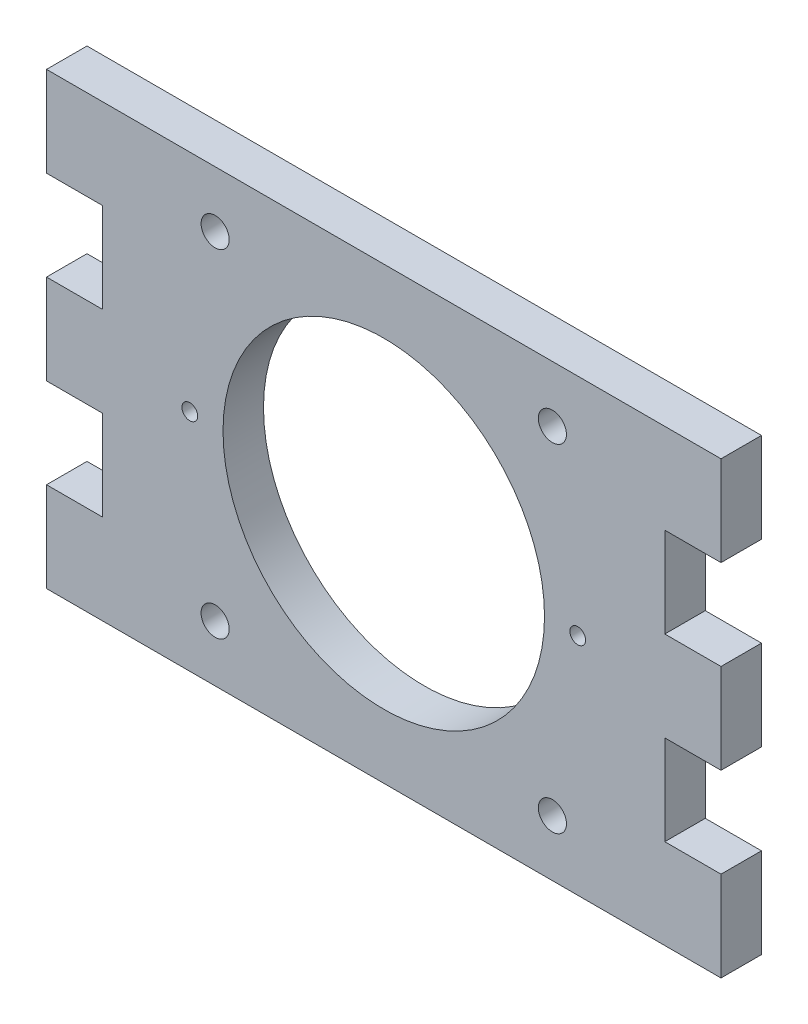
ISO-10303-21;
HEADER;
FILE_DESCRIPTION(('STEP AP214'),'2;1');
FILE_NAME('part.step','',(''),(''),'','','');
FILE_SCHEMA(('AUTOMOTIVE_DESIGN { 1 0 10303 214 1 1 1 1 }'));
ENDSEC;
DATA;
#1=APPLICATION_CONTEXT('core data for automotive mechanical design processes');
#2=APPLICATION_PROTOCOL_DEFINITION('international standard','automotive_design',2000,#1);
#3=PRODUCT_CONTEXT('',#1,'mechanical');
#4=PRODUCT('Part','Part','',(#3));
#5=PRODUCT_RELATED_PRODUCT_CATEGORY('part','',(#4));
#6=PRODUCT_DEFINITION_FORMATION('','',#4);
#7=PRODUCT_DEFINITION_CONTEXT('part definition',#1,'design');
#8=PRODUCT_DEFINITION('design','',#6,#7);
#9=PRODUCT_DEFINITION_SHAPE('','',#8);
#10=(LENGTH_UNIT() NAMED_UNIT(*) SI_UNIT(.MILLI.,.METRE.));
#11=(NAMED_UNIT(*) PLANE_ANGLE_UNIT() SI_UNIT($,.RADIAN.));
#12=(NAMED_UNIT(*) SI_UNIT($,.STERADIAN.) SOLID_ANGLE_UNIT());
#13=UNCERTAINTY_MEASURE_WITH_UNIT(LENGTH_MEASURE(1.E-05),#10,'distance_accuracy_value','');
#14=(GEOMETRIC_REPRESENTATION_CONTEXT(3) GLOBAL_UNCERTAINTY_ASSIGNED_CONTEXT((#13)) GLOBAL_UNIT_ASSIGNED_CONTEXT((#10,
#11,#12)) REPRESENTATION_CONTEXT('',''));
#15=CARTESIAN_POINT('',(0.,0.,0.));
#16=DIRECTION('',(0.,0.,1.));
#17=DIRECTION('',(1.,0.,0.));
#18=AXIS2_PLACEMENT_3D('',#15,#16,#17);
#19=CARTESIAN_POINT('',(0.,50.8,4.572));
#20=DIRECTION('',(0.,0.,-1.));
#21=DIRECTION('',(-1.,0.,0.));
#22=AXIS2_PLACEMENT_3D('',#19,#20,#21);
#23=PLANE('',#22);
#24=CARTESIAN_POINT('',(57.1500000000031,44.4500000000028,4.572));
#25=DIRECTION('',(0.,0.,-1.));
#26=DIRECTION('',(-1.,0.,0.));
#27=AXIS2_PLACEMENT_3D('',#24,#25,#26);
#28=CIRCLE('',#27,1.58750000000206);
#29=CARTESIAN_POINT('',(55.562500000001,44.4500000000028,4.572));
#30=VERTEX_POINT('',#29);
#31=EDGE_CURVE('E275',#30,#30,#28,.T.);
#32=ORIENTED_EDGE('',*,*,#31,.T.);
#33=EDGE_LOOP('',(#32));
#34=FACE_BOUND('',#33,.T.);
#35=CARTESIAN_POINT('',(19.0499999999992,44.4500000000001,4.572));
#36=DIRECTION('',(0.,0.,-1.));
#37=DIRECTION('',(-1.,0.,0.));
#38=AXIS2_PLACEMENT_3D('',#35,#36,#37);
#39=CIRCLE('',#38,1.58749999999917);
#40=CARTESIAN_POINT('',(17.4625,44.4500000000001,4.572));
#41=VERTEX_POINT('',#40);
#42=EDGE_CURVE('E282',#41,#41,#39,.T.);
#43=ORIENTED_EDGE('',*,*,#42,.T.);
#44=EDGE_LOOP('',(#43));
#45=FACE_BOUND('',#44,.T.);
#46=CARTESIAN_POINT('',(57.15,6.34999999999998,4.572));
#47=DIRECTION('',(0.,0.,-1.));
#48=DIRECTION('',(-1.,0.,0.));
#49=AXIS2_PLACEMENT_3D('',#46,#47,#48);
#50=CIRCLE('',#49,1.5875);
#51=CARTESIAN_POINT('',(55.5625,6.34999999999998,4.572));
#52=VERTEX_POINT('',#51);
#53=EDGE_CURVE('E288',#52,#52,#50,.T.);
#54=ORIENTED_EDGE('',*,*,#53,.T.);
#55=EDGE_LOOP('',(#54));
#56=FACE_BOUND('',#55,.T.);
#57=CARTESIAN_POINT('',(19.05,6.34999999999997,4.572));
#58=DIRECTION('',(0.,0.,-1.));
#59=DIRECTION('',(-1.,0.,0.));
#60=AXIS2_PLACEMENT_3D('',#57,#58,#59);
#61=CIRCLE('',#60,1.5875);
#62=CARTESIAN_POINT('',(17.4625,6.34999999999997,4.572));
#63=VERTEX_POINT('',#62);
#64=EDGE_CURVE('E294',#63,#63,#61,.T.);
#65=ORIENTED_EDGE('',*,*,#64,.T.);
#66=EDGE_LOOP('',(#65));
#67=FACE_BOUND('',#66,.T.);
#68=CARTESIAN_POINT('',(16.1881750645913,25.4,4.572));
#69=DIRECTION('',(0.,0.,-1.));
#70=DIRECTION('',(-1.,0.,0.));
#71=AXIS2_PLACEMENT_3D('',#68,#69,#70);
#72=CIRCLE('',#71,0.888999999999999);
#73=CARTESIAN_POINT('',(15.2991750645913,25.4,4.572));
#74=VERTEX_POINT('',#73);
#75=EDGE_CURVE('E308',#74,#74,#72,.F.);
#76=ORIENTED_EDGE('',*,*,#75,.F.);
#77=EDGE_LOOP('',(#76));
#78=FACE_BOUND('',#77,.T.);
#79=CARTESIAN_POINT('',(38.1,25.4,4.572));
#80=DIRECTION('',(0.,0.,-1.));
#81=DIRECTION('',(-1.,0.,0.));
#82=AXIS2_PLACEMENT_3D('',#79,#80,#81);
#83=CIRCLE('',#82,18.161);
#84=CARTESIAN_POINT('',(19.939,25.4,4.572));
#85=VERTEX_POINT('',#84);
#86=EDGE_CURVE('E305',#85,#85,#83,.F.);
#87=ORIENTED_EDGE('',*,*,#86,.F.);
#88=EDGE_LOOP('',(#87));
#89=FACE_BOUND('',#88,.T.);
#90=CARTESIAN_POINT('',(60.0118249354087,25.4,4.572));
#91=DIRECTION('',(0.,0.,-1.));
#92=DIRECTION('',(-1.,0.,0.));
#93=AXIS2_PLACEMENT_3D('',#90,#91,#92);
#94=CIRCLE('',#93,0.889000000000003);
#95=CARTESIAN_POINT('',(59.1228249354087,25.4,4.572));
#96=VERTEX_POINT('',#95);
#97=EDGE_CURVE('E311',#96,#96,#94,.F.);
#98=ORIENTED_EDGE('',*,*,#97,.F.);
#99=EDGE_LOOP('',(#98));
#100=FACE_BOUND('',#99,.T.);
#101=DIRECTION('',(-1.,0.,0.));
#102=VECTOR('',#101,1.);
#103=CARTESIAN_POINT('',(76.2,40.64,4.572));
#104=LINE('',#103,#102);
#105=CARTESIAN_POINT('',(76.2,40.64,4.572));
#106=VERTEX_POINT('',#105);
#107=CARTESIAN_POINT('',(69.85,40.64,4.572));
#108=VERTEX_POINT('',#107);
#109=EDGE_CURVE('E218',#106,#108,#104,.T.);
#110=ORIENTED_EDGE('',*,*,#109,.F.);
#111=DIRECTION('',(0.,1.,0.));
#112=VECTOR('',#111,1.);
#113=CARTESIAN_POINT('',(76.2,0.,4.572));
#114=LINE('',#113,#112);
#115=CARTESIAN_POINT('',(76.2,50.8,4.572));
#116=VERTEX_POINT('',#115);
#117=EDGE_CURVE('E322',#106,#116,#114,.T.);
#118=ORIENTED_EDGE('',*,*,#117,.T.);
#119=DIRECTION('',(-1.,0.,0.));
#120=VECTOR('',#119,1.);
#121=CARTESIAN_POINT('',(0.,50.8,4.572));
#122=LINE('',#121,#120);
#123=CARTESIAN_POINT('',(0.,50.8,4.572));
#124=VERTEX_POINT('',#123);
#125=EDGE_CURVE('E324',#116,#124,#122,.T.);
#126=ORIENTED_EDGE('',*,*,#125,.T.);
#127=DIRECTION('',(0.,-1.,0.));
#128=VECTOR('',#127,1.);
#129=CARTESIAN_POINT('',(0.,0.,4.572));
#130=LINE('',#129,#128);
#131=CARTESIAN_POINT('',(0.,40.64,4.572));
#132=VERTEX_POINT('',#131);
#133=EDGE_CURVE('E315',#124,#132,#130,.T.);
#134=ORIENTED_EDGE('',*,*,#133,.T.);
#135=DIRECTION('',(-1.,0.,0.));
#136=VECTOR('',#135,1.);
#137=CARTESIAN_POINT('',(6.34999999999997,40.64,4.572));
#138=LINE('',#137,#136);
#139=CARTESIAN_POINT('',(6.34999999999997,40.64,4.572));
#140=VERTEX_POINT('',#139);
#141=EDGE_CURVE('E265',#140,#132,#138,.T.);
#142=ORIENTED_EDGE('',*,*,#141,.F.);
#143=DIRECTION('',(0.,1.,0.));
#144=VECTOR('',#143,1.);
#145=CARTESIAN_POINT('',(6.34999999999997,0.,4.572));
#146=LINE('',#145,#144);
#147=CARTESIAN_POINT('',(6.34999999999997,30.48,4.572));
#148=VERTEX_POINT('',#147);
#149=EDGE_CURVE('E267',#148,#140,#146,.T.);
#150=ORIENTED_EDGE('',*,*,#149,.F.);
#151=DIRECTION('',(-1.,0.,0.));
#152=VECTOR('',#151,1.);
#153=CARTESIAN_POINT('',(6.34999999999997,30.48,4.572));
#154=LINE('',#153,#152);
#155=CARTESIAN_POINT('',(0.,30.48,4.572));
#156=VERTEX_POINT('',#155);
#157=EDGE_CURVE('E244',#148,#156,#154,.T.);
#158=ORIENTED_EDGE('',*,*,#157,.T.);
#159=CARTESIAN_POINT('',(0.,20.32,4.572));
#160=VERTEX_POINT('',#159);
#161=EDGE_CURVE('E319',#156,#160,#130,.T.);
#162=ORIENTED_EDGE('',*,*,#161,.T.);
#163=DIRECTION('',(-1.,0.,0.));
#164=VECTOR('',#163,1.);
#165=CARTESIAN_POINT('',(6.34999999999997,20.32,4.572));
#166=LINE('',#165,#164);
#167=CARTESIAN_POINT('',(6.34999999999997,20.32,4.572));
#168=VERTEX_POINT('',#167);
#169=EDGE_CURVE('E249',#168,#160,#166,.T.);
#170=ORIENTED_EDGE('',*,*,#169,.F.);
#171=CARTESIAN_POINT('',(6.34999999999997,10.16,4.572));
#172=VERTEX_POINT('',#171);
#173=EDGE_CURVE('E270',#172,#168,#146,.T.);
#174=ORIENTED_EDGE('',*,*,#173,.F.);
#175=DIRECTION('',(-1.,0.,0.));
#176=VECTOR('',#175,1.);
#177=CARTESIAN_POINT('',(6.34999999999997,10.16,4.572));
#178=LINE('',#177,#176);
#179=CARTESIAN_POINT('',(0.,10.16,4.572));
#180=VERTEX_POINT('',#179);
#181=EDGE_CURVE('E228',#172,#180,#178,.T.);
#182=ORIENTED_EDGE('',*,*,#181,.T.);
#183=CARTESIAN_POINT('',(0.,0.,4.572));
#184=VERTEX_POINT('',#183);
#185=EDGE_CURVE('E320',#180,#184,#130,.T.);
#186=ORIENTED_EDGE('',*,*,#185,.T.);
#187=DIRECTION('',(1.,0.,0.));
#188=VECTOR('',#187,1.);
#189=CARTESIAN_POINT('',(0.,0.,4.572));
#190=LINE('',#189,#188);
#191=CARTESIAN_POINT('',(76.2,0.,4.572));
#192=VERTEX_POINT('',#191);
#193=EDGE_CURVE('E318',#184,#192,#190,.T.);
#194=ORIENTED_EDGE('',*,*,#193,.T.);
#195=CARTESIAN_POINT('',(76.2,10.16,4.572));
#196=VERTEX_POINT('',#195);
#197=EDGE_CURVE('E192',#192,#196,#114,.T.);
#198=ORIENTED_EDGE('',*,*,#197,.T.);
#199=DIRECTION('',(-1.,0.,0.));
#200=VECTOR('',#199,1.);
#201=CARTESIAN_POINT('',(76.2,10.16,4.572));
#202=LINE('',#201,#200);
#203=CARTESIAN_POINT('',(69.85,10.16,4.572));
#204=VERTEX_POINT('',#203);
#205=EDGE_CURVE('E57',#196,#204,#202,.T.);
#206=ORIENTED_EDGE('',*,*,#205,.T.);
#207=DIRECTION('',(0.,1.,0.));
#208=VECTOR('',#207,1.);
#209=CARTESIAN_POINT('',(69.85,0.,4.572));
#210=LINE('',#209,#208);
#211=CARTESIAN_POINT('',(69.85,20.32,4.572));
#212=VERTEX_POINT('',#211);
#213=EDGE_CURVE('E179',#204,#212,#210,.T.);
#214=ORIENTED_EDGE('',*,*,#213,.T.);
#215=DIRECTION('',(-1.,0.,0.));
#216=VECTOR('',#215,1.);
#217=CARTESIAN_POINT('',(76.2,20.32,4.572));
#218=LINE('',#217,#216);
#219=CARTESIAN_POINT('',(76.2,20.32,4.572));
#220=VERTEX_POINT('',#219);
#221=EDGE_CURVE('E205',#220,#212,#218,.T.);
#222=ORIENTED_EDGE('',*,*,#221,.F.);
#223=CARTESIAN_POINT('',(76.2,30.48,4.572));
#224=VERTEX_POINT('',#223);
#225=EDGE_CURVE('E325',#220,#224,#114,.T.);
#226=ORIENTED_EDGE('',*,*,#225,.T.);
#227=DIRECTION('',(-1.,0.,0.));
#228=VECTOR('',#227,1.);
#229=CARTESIAN_POINT('',(76.2,30.48,4.572));
#230=LINE('',#229,#228);
#231=CARTESIAN_POINT('',(69.85,30.48,4.572));
#232=VERTEX_POINT('',#231);
#233=EDGE_CURVE('E49',#224,#232,#230,.T.);
#234=ORIENTED_EDGE('',*,*,#233,.T.);
#235=EDGE_CURVE('E187',#232,#108,#210,.T.);
#236=ORIENTED_EDGE('',*,*,#235,.T.);
#237=EDGE_LOOP('',(#110,#118,#126,#134,#142,#150,#158,#162,#170,#174,#182,#186,#194,#198,#206,
#214,#222,#226,#234,#236));
#238=FACE_BOUND('',#237,.T.);
#239=ADVANCED_FACE('F34',(#34,#45,#56,#67,#78,#89,#100,#238),#23,.F.);
#240=CARTESIAN_POINT('',(76.2,0.,4.572));
#241=DIRECTION('',(-1.,0.,0.));
#242=DIRECTION('',(0.,-1.,0.));
#243=AXIS2_PLACEMENT_3D('',#240,#241,#242);
#244=PLANE('',#243);
#245=DIRECTION('',(0.,0.,1.));
#246=VECTOR('',#245,1.);
#247=CARTESIAN_POINT('',(76.2,40.64,4.572));
#248=LINE('',#247,#246);
#249=CARTESIAN_POINT('',(76.2,40.64,0.));
#250=VERTEX_POINT('',#249);
#251=EDGE_CURVE('E214',#250,#106,#248,.T.);
#252=ORIENTED_EDGE('',*,*,#251,.F.);
#253=DIRECTION('',(0.,1.,0.));
#254=VECTOR('',#253,1.);
#255=CARTESIAN_POINT('',(76.2,0.,0.));
#256=LINE('',#255,#254);
#257=CARTESIAN_POINT('',(76.2,50.8,0.));
#258=VERTEX_POINT('',#257);
#259=EDGE_CURVE('E334',#250,#258,#256,.T.);
#260=ORIENTED_EDGE('',*,*,#259,.T.);
#261=DIRECTION('',(0.,0.,-1.));
#262=VECTOR('',#261,1.);
#263=CARTESIAN_POINT('',(76.2,50.8,4.572));
#264=LINE('',#263,#262);
#265=EDGE_CURVE('E343',#116,#258,#264,.T.);
#266=ORIENTED_EDGE('',*,*,#265,.F.);
#267=ORIENTED_EDGE('',*,*,#117,.F.);
#268=EDGE_LOOP('',(#252,#260,#266,#267));
#269=FACE_BOUND('',#268,.T.);
#270=ADVANCED_FACE('F369',(#269),#244,.F.);
#271=DIRECTION('',(0.,0.,1.));
#272=VECTOR('',#271,1.);
#273=CARTESIAN_POINT('',(76.2,20.32,4.572));
#274=LINE('',#273,#272);
#275=CARTESIAN_POINT('',(76.2,20.32,0.));
#276=VERTEX_POINT('',#275);
#277=EDGE_CURVE('E200',#276,#220,#274,.T.);
#278=ORIENTED_EDGE('',*,*,#277,.F.);
#279=CARTESIAN_POINT('',(76.2,30.48,0.));
#280=VERTEX_POINT('',#279);
#281=EDGE_CURVE('E339',#276,#280,#256,.T.);
#282=ORIENTED_EDGE('',*,*,#281,.T.);
#283=DIRECTION('',(0.,0.,-1.));
#284=VECTOR('',#283,1.);
#285=CARTESIAN_POINT('',(76.2,30.48,4.572));
#286=LINE('',#285,#284);
#287=EDGE_CURVE('E198',#224,#280,#286,.T.);
#288=ORIENTED_EDGE('',*,*,#287,.F.);
#289=ORIENTED_EDGE('',*,*,#225,.F.);
#290=EDGE_LOOP('',(#278,#282,#288,#289));
#291=FACE_BOUND('',#290,.T.);
#292=ADVANCED_FACE('F367',(#291),#244,.F.);
#293=DIRECTION('',(0.,0.,-1.));
#294=VECTOR('',#293,1.);
#295=CARTESIAN_POINT('',(76.2,10.16,4.572));
#296=LINE('',#295,#294);
#297=CARTESIAN_POINT('',(76.2,10.16,0.));
#298=VERTEX_POINT('',#297);
#299=EDGE_CURVE('E176',#196,#298,#296,.T.);
#300=ORIENTED_EDGE('',*,*,#299,.F.);
#301=ORIENTED_EDGE('',*,*,#197,.F.);
#302=DIRECTION('',(0.,0.,-1.));
#303=VECTOR('',#302,1.);
#304=CARTESIAN_POINT('',(76.2,0.,4.572));
#305=LINE('',#304,#303);
#306=CARTESIAN_POINT('',(76.2,0.,0.));
#307=VERTEX_POINT('',#306);
#308=EDGE_CURVE('E346',#192,#307,#305,.T.);
#309=ORIENTED_EDGE('',*,*,#308,.T.);
#310=EDGE_CURVE('E335',#307,#298,#256,.T.);
#311=ORIENTED_EDGE('',*,*,#310,.T.);
#312=EDGE_LOOP('',(#300,#301,#309,#311));
#313=FACE_BOUND('',#312,.T.);
#314=ADVANCED_FACE('F365',(#313),#244,.F.);
#315=CARTESIAN_POINT('',(0.,0.,4.572));
#316=DIRECTION('',(1.,0.,0.));
#317=DIRECTION('',(0.,1.,0.));
#318=AXIS2_PLACEMENT_3D('',#315,#316,#317);
#319=PLANE('',#318);
#320=DIRECTION('',(0.,0.,1.));
#321=VECTOR('',#320,1.);
#322=CARTESIAN_POINT('',(0.,40.64,4.572));
#323=LINE('',#322,#321);
#324=CARTESIAN_POINT('',(0.,40.64,0.));
#325=VERTEX_POINT('',#324);
#326=EDGE_CURVE('E251',#325,#132,#323,.T.);
#327=ORIENTED_EDGE('',*,*,#326,.T.);
#328=ORIENTED_EDGE('',*,*,#133,.F.);
#329=DIRECTION('',(0.,0.,-1.));
#330=VECTOR('',#329,1.);
#331=CARTESIAN_POINT('',(0.,50.8,4.572));
#332=LINE('',#331,#330);
#333=CARTESIAN_POINT('',(0.,50.8,0.));
#334=VERTEX_POINT('',#333);
#335=EDGE_CURVE('E327',#124,#334,#332,.T.);
#336=ORIENTED_EDGE('',*,*,#335,.T.);
#337=DIRECTION('',(0.,-1.,0.));
#338=VECTOR('',#337,1.);
#339=CARTESIAN_POINT('',(0.,0.,0.));
#340=LINE('',#339,#338);
#341=EDGE_CURVE('E328',#334,#325,#340,.T.);
#342=ORIENTED_EDGE('',*,*,#341,.T.);
#343=EDGE_LOOP('',(#327,#328,#336,#342));
#344=FACE_BOUND('',#343,.T.);
#345=ADVANCED_FACE('F36',(#344),#319,.F.);
#346=DIRECTION('',(0.,0.,1.));
#347=VECTOR('',#346,1.);
#348=CARTESIAN_POINT('',(0.,20.32,4.572));
#349=LINE('',#348,#347);
#350=CARTESIAN_POINT('',(0.,20.32,0.));
#351=VERTEX_POINT('',#350);
#352=EDGE_CURVE('E241',#351,#160,#349,.T.);
#353=ORIENTED_EDGE('',*,*,#352,.T.);
#354=ORIENTED_EDGE('',*,*,#161,.F.);
#355=DIRECTION('',(0.,0.,-1.));
#356=VECTOR('',#355,1.);
#357=CARTESIAN_POINT('',(0.,30.48,4.572));
#358=LINE('',#357,#356);
#359=CARTESIAN_POINT('',(0.,30.48,0.));
#360=VERTEX_POINT('',#359);
#361=EDGE_CURVE('E234',#156,#360,#358,.T.);
#362=ORIENTED_EDGE('',*,*,#361,.T.);
#363=EDGE_CURVE('E332',#360,#351,#340,.T.);
#364=ORIENTED_EDGE('',*,*,#363,.T.);
#365=EDGE_LOOP('',(#353,#354,#362,#364));
#366=FACE_BOUND('',#365,.T.);
#367=ADVANCED_FACE('F374',(#366),#319,.F.);
#368=DIRECTION('',(0.,0.,-1.));
#369=VECTOR('',#368,1.);
#370=CARTESIAN_POINT('',(0.,10.16,4.572));
#371=LINE('',#370,#369);
#372=CARTESIAN_POINT('',(0.,10.16,0.));
#373=VERTEX_POINT('',#372);
#374=EDGE_CURVE('E229',#180,#373,#371,.T.);
#375=ORIENTED_EDGE('',*,*,#374,.T.);
#376=CARTESIAN_POINT('',(0.,0.,0.));
#377=VERTEX_POINT('',#376);
#378=EDGE_CURVE('E314',#373,#377,#340,.T.);
#379=ORIENTED_EDGE('',*,*,#378,.T.);
#380=DIRECTION('',(0.,0.,-1.));
#381=VECTOR('',#380,1.);
#382=CARTESIAN_POINT('',(0.,0.,4.572));
#383=LINE('',#382,#381);
#384=EDGE_CURVE('E42',#184,#377,#383,.T.);
#385=ORIENTED_EDGE('',*,*,#384,.F.);
#386=ORIENTED_EDGE('',*,*,#185,.F.);
#387=EDGE_LOOP('',(#375,#379,#385,#386));
#388=FACE_BOUND('',#387,.T.);
#389=ADVANCED_FACE('F357',(#388),#319,.F.);
#390=CARTESIAN_POINT('',(0.,50.8,0.));
#391=DIRECTION('',(0.,0.,-1.));
#392=DIRECTION('',(-1.,0.,0.));
#393=AXIS2_PLACEMENT_3D('',#390,#391,#392);
#394=PLANE('',#393);
#395=ORIENTED_EDGE('',*,*,#310,.F.);
#396=DIRECTION('',(1.,0.,0.));
#397=VECTOR('',#396,1.);
#398=CARTESIAN_POINT('',(0.,0.,0.));
#399=LINE('',#398,#397);
#400=EDGE_CURVE('E331',#377,#307,#399,.T.);
#401=ORIENTED_EDGE('',*,*,#400,.F.);
#402=ORIENTED_EDGE('',*,*,#378,.F.);
#403=DIRECTION('',(-1.,0.,0.));
#404=VECTOR('',#403,1.);
#405=CARTESIAN_POINT('',(6.34999999999997,10.16,0.));
#406=LINE('',#405,#404);
#407=CARTESIAN_POINT('',(6.34999999999997,10.16,0.));
#408=VERTEX_POINT('',#407);
#409=EDGE_CURVE('E232',#408,#373,#406,.T.);
#410=ORIENTED_EDGE('',*,*,#409,.F.);
#411=DIRECTION('',(0.,-1.,0.));
#412=VECTOR('',#411,1.);
#413=CARTESIAN_POINT('',(6.34999999999997,50.8,0.));
#414=LINE('',#413,#412);
#415=CARTESIAN_POINT('',(6.34999999999997,20.32,0.));
#416=VERTEX_POINT('',#415);
#417=EDGE_CURVE('E272',#416,#408,#414,.T.);
#418=ORIENTED_EDGE('',*,*,#417,.F.);
#419=DIRECTION('',(-1.,0.,0.));
#420=VECTOR('',#419,1.);
#421=CARTESIAN_POINT('',(6.34999999999997,20.32,0.));
#422=LINE('',#421,#420);
#423=EDGE_CURVE('E252',#416,#351,#422,.T.);
#424=ORIENTED_EDGE('',*,*,#423,.T.);
#425=ORIENTED_EDGE('',*,*,#363,.F.);
#426=DIRECTION('',(-1.,0.,0.));
#427=VECTOR('',#426,1.);
#428=CARTESIAN_POINT('',(6.34999999999997,30.48,0.));
#429=LINE('',#428,#427);
#430=CARTESIAN_POINT('',(6.34999999999997,30.48,0.));
#431=VERTEX_POINT('',#430);
#432=EDGE_CURVE('E255',#431,#360,#429,.T.);
#433=ORIENTED_EDGE('',*,*,#432,.F.);
#434=CARTESIAN_POINT('',(6.34999999999997,40.64,0.));
#435=VERTEX_POINT('',#434);
#436=EDGE_CURVE('E274',#435,#431,#414,.T.);
#437=ORIENTED_EDGE('',*,*,#436,.F.);
#438=DIRECTION('',(-1.,0.,0.));
#439=VECTOR('',#438,1.);
#440=CARTESIAN_POINT('',(6.34999999999997,40.64,0.));
#441=LINE('',#440,#439);
#442=EDGE_CURVE('E262',#435,#325,#441,.T.);
#443=ORIENTED_EDGE('',*,*,#442,.T.);
#444=ORIENTED_EDGE('',*,*,#341,.F.);
#445=DIRECTION('',(-1.,0.,0.));
#446=VECTOR('',#445,1.);
#447=CARTESIAN_POINT('',(0.,50.8,0.));
#448=LINE('',#447,#446);
#449=EDGE_CURVE('E338',#258,#334,#448,.T.);
#450=ORIENTED_EDGE('',*,*,#449,.F.);
#451=ORIENTED_EDGE('',*,*,#259,.F.);
#452=DIRECTION('',(-1.,0.,0.));
#453=VECTOR('',#452,1.);
#454=CARTESIAN_POINT('',(76.2,40.64,0.));
#455=LINE('',#454,#453);
#456=CARTESIAN_POINT('',(69.85,40.64,0.));
#457=VERTEX_POINT('',#456);
#458=EDGE_CURVE('E216',#250,#457,#455,.T.);
#459=ORIENTED_EDGE('',*,*,#458,.T.);
#460=DIRECTION('',(0.,-1.,0.));
#461=VECTOR('',#460,1.);
#462=CARTESIAN_POINT('',(69.85,50.8,0.));
#463=LINE('',#462,#461);
#464=CARTESIAN_POINT('',(69.85,30.48,0.));
#465=VERTEX_POINT('',#464);
#466=EDGE_CURVE('E224',#457,#465,#463,.T.);
#467=ORIENTED_EDGE('',*,*,#466,.T.);
#468=DIRECTION('',(-1.,0.,0.));
#469=VECTOR('',#468,1.);
#470=CARTESIAN_POINT('',(76.2,30.48,0.));
#471=LINE('',#470,#469);
#472=EDGE_CURVE('E211',#280,#465,#471,.T.);
#473=ORIENTED_EDGE('',*,*,#472,.F.);
#474=ORIENTED_EDGE('',*,*,#281,.F.);
#475=DIRECTION('',(-1.,0.,0.));
#476=VECTOR('',#475,1.);
#477=CARTESIAN_POINT('',(76.2,20.32,0.));
#478=LINE('',#477,#476);
#479=CARTESIAN_POINT('',(69.85,20.32,0.));
#480=VERTEX_POINT('',#479);
#481=EDGE_CURVE('E208',#276,#480,#478,.T.);
#482=ORIENTED_EDGE('',*,*,#481,.T.);
#483=CARTESIAN_POINT('',(69.85,10.16,0.));
#484=VERTEX_POINT('',#483);
#485=EDGE_CURVE('E186',#480,#484,#463,.T.);
#486=ORIENTED_EDGE('',*,*,#485,.T.);
#487=DIRECTION('',(-1.,0.,0.));
#488=VECTOR('',#487,1.);
#489=CARTESIAN_POINT('',(76.2,10.16,0.));
#490=LINE('',#489,#488);
#491=EDGE_CURVE('E173',#298,#484,#490,.T.);
#492=ORIENTED_EDGE('',*,*,#491,.F.);
#493=EDGE_LOOP('',(#395,#401,#402,#410,#418,#424,#425,#433,#437,#443,#444,#450,#451,#459,#467,
#473,#474,#482,#486,#492));
#494=FACE_BOUND('',#493,.T.);
#495=CARTESIAN_POINT('',(57.1500000000031,44.4500000000028,0.));
#496=DIRECTION('',(0.,0.,-1.));
#497=DIRECTION('',(-1.,0.,0.));
#498=AXIS2_PLACEMENT_3D('',#495,#496,#497);
#499=CIRCLE('',#498,1.58750000000206);
#500=CARTESIAN_POINT('',(55.562500000001,44.4500000000028,0.));
#501=VERTEX_POINT('',#500);
#502=EDGE_CURVE('E279',#501,#501,#499,.T.);
#503=ORIENTED_EDGE('',*,*,#502,.F.);
#504=EDGE_LOOP('',(#503));
#505=FACE_BOUND('',#504,.T.);
#506=CARTESIAN_POINT('',(19.0499999999992,44.4500000000001,0.));
#507=DIRECTION('',(0.,0.,-1.));
#508=DIRECTION('',(-1.,0.,0.));
#509=AXIS2_PLACEMENT_3D('',#506,#507,#508);
#510=CIRCLE('',#509,1.58749999999917);
#511=CARTESIAN_POINT('',(17.4625,44.4500000000001,0.));
#512=VERTEX_POINT('',#511);
#513=EDGE_CURVE('E278',#512,#512,#510,.T.);
#514=ORIENTED_EDGE('',*,*,#513,.F.);
#515=EDGE_LOOP('',(#514));
#516=FACE_BOUND('',#515,.T.);
#517=CARTESIAN_POINT('',(57.15,6.34999999999998,0.));
#518=DIRECTION('',(0.,0.,-1.));
#519=DIRECTION('',(-1.,0.,0.));
#520=AXIS2_PLACEMENT_3D('',#517,#518,#519);
#521=CIRCLE('',#520,1.5875);
#522=CARTESIAN_POINT('',(55.5625,6.34999999999998,0.));
#523=VERTEX_POINT('',#522);
#524=EDGE_CURVE('E285',#523,#523,#521,.T.);
#525=ORIENTED_EDGE('',*,*,#524,.F.);
#526=EDGE_LOOP('',(#525));
#527=FACE_BOUND('',#526,.T.);
#528=CARTESIAN_POINT('',(19.05,6.34999999999997,0.));
#529=DIRECTION('',(0.,0.,-1.));
#530=DIRECTION('',(-1.,0.,0.));
#531=AXIS2_PLACEMENT_3D('',#528,#529,#530);
#532=CIRCLE('',#531,1.5875);
#533=CARTESIAN_POINT('',(17.4625,6.34999999999997,0.));
#534=VERTEX_POINT('',#533);
#535=EDGE_CURVE('E291',#534,#534,#532,.T.);
#536=ORIENTED_EDGE('',*,*,#535,.F.);
#537=EDGE_LOOP('',(#536));
#538=FACE_BOUND('',#537,.T.);
#539=CARTESIAN_POINT('',(38.1,25.4,0.));
#540=DIRECTION('',(0.,0.,-1.));
#541=DIRECTION('',(-1.,0.,0.));
#542=AXIS2_PLACEMENT_3D('',#539,#540,#541);
#543=CIRCLE('',#542,18.161);
#544=CARTESIAN_POINT('',(19.939,25.4,0.));
#545=VERTEX_POINT('',#544);
#546=EDGE_CURVE('E11',#545,#545,#543,.F.);
#547=ORIENTED_EDGE('',*,*,#546,.T.);
#548=EDGE_LOOP('',(#547));
#549=FACE_BOUND('',#548,.T.);
#550=CARTESIAN_POINT('',(60.0118249354087,25.4,0.));
#551=DIRECTION('',(0.,0.,1.));
#552=DIRECTION('',(0.707106781186548,-0.707106781186548,0.));
#553=AXIS2_PLACEMENT_3D('',#550,#551,#552);
#554=CIRCLE('',#553,0.889000000000003);
#555=CARTESIAN_POINT('',(60.6404428638835,24.7713820715252,0.));
#556=VERTEX_POINT('',#555);
#557=EDGE_CURVE('E302',#556,#556,#554,.T.);
#558=ORIENTED_EDGE('',*,*,#557,.T.);
#559=EDGE_LOOP('',(#558));
#560=FACE_BOUND('',#559,.T.);
#561=CARTESIAN_POINT('',(16.1881750645913,25.4,0.));
#562=DIRECTION('',(0.,0.,1.));
#563=DIRECTION('',(0.707106781186548,-0.707106781186548,0.));
#564=AXIS2_PLACEMENT_3D('',#561,#562,#563);
#565=CIRCLE('',#564,0.888999999999999);
#566=CARTESIAN_POINT('',(16.8167929930661,24.7713820715251,0.));
#567=VERTEX_POINT('',#566);
#568=EDGE_CURVE('E297',#567,#567,#565,.T.);
#569=ORIENTED_EDGE('',*,*,#568,.T.);
#570=EDGE_LOOP('',(#569));
#571=FACE_BOUND('',#570,.T.);
#572=ADVANCED_FACE('F362',(#494,#505,#516,#527,#538,#549,#560,#571),#394,.T.);
#573=CARTESIAN_POINT('',(0.,0.,4.572));
#574=DIRECTION('',(0.,1.,0.));
#575=DIRECTION('',(0.,0.,1.));
#576=AXIS2_PLACEMENT_3D('',#573,#574,#575);
#577=PLANE('',#576);
#578=ORIENTED_EDGE('',*,*,#400,.T.);
#579=ORIENTED_EDGE('',*,*,#308,.F.);
#580=ORIENTED_EDGE('',*,*,#193,.F.);
#581=ORIENTED_EDGE('',*,*,#384,.T.);
#582=EDGE_LOOP('',(#578,#579,#580,#581));
#583=FACE_BOUND('',#582,.T.);
#584=ADVANCED_FACE('F352',(#583),#577,.F.);
#585=CARTESIAN_POINT('',(0.,50.8,4.572));
#586=DIRECTION('',(0.,-1.,0.));
#587=DIRECTION('',(0.,0.,-1.));
#588=AXIS2_PLACEMENT_3D('',#585,#586,#587);
#589=PLANE('',#588);
#590=ORIENTED_EDGE('',*,*,#449,.T.);
#591=ORIENTED_EDGE('',*,*,#335,.F.);
#592=ORIENTED_EDGE('',*,*,#125,.F.);
#593=ORIENTED_EDGE('',*,*,#265,.T.);
#594=EDGE_LOOP('',(#590,#591,#592,#593));
#595=FACE_BOUND('',#594,.T.);
#596=ADVANCED_FACE('F391',(#595),#589,.F.);
#597=CARTESIAN_POINT('',(38.1,25.4,-2.54));
#598=DIRECTION('',(0.,0.,1.));
#599=DIRECTION('',(0.707106781186548,-0.707106781186548,0.));
#600=AXIS2_PLACEMENT_3D('',#597,#598,#599);
#601=CYLINDRICAL_SURFACE('',#600,18.161);
#602=ORIENTED_EDGE('',*,*,#546,.F.);
#603=EDGE_LOOP('',(#602));
#604=FACE_BOUND('',#603,.T.);
#605=ORIENTED_EDGE('',*,*,#86,.T.);
#606=EDGE_LOOP('',(#605));
#607=FACE_BOUND('',#606,.T.);
#608=ADVANCED_FACE('F393',(#604,#607),#601,.F.);
#609=CARTESIAN_POINT('',(16.1881750645913,25.4,25.4));
#610=DIRECTION('',(0.,0.,-1.));
#611=DIRECTION('',(-0.707106781186548,0.707106781186548,0.));
#612=AXIS2_PLACEMENT_3D('',#609,#610,#611);
#613=CYLINDRICAL_SURFACE('',#612,0.888999999999999);
#614=ORIENTED_EDGE('',*,*,#568,.F.);
#615=EDGE_LOOP('',(#614));
#616=FACE_BOUND('',#615,.T.);
#617=ORIENTED_EDGE('',*,*,#75,.T.);
#618=EDGE_LOOP('',(#617));
#619=FACE_BOUND('',#618,.T.);
#620=ADVANCED_FACE('F399',(#616,#619),#613,.F.);
#621=CARTESIAN_POINT('',(60.0118249354087,25.4,25.4));
#622=DIRECTION('',(0.,0.,-1.));
#623=DIRECTION('',(-0.707106781186548,0.707106781186548,0.));
#624=AXIS2_PLACEMENT_3D('',#621,#622,#623);
#625=CYLINDRICAL_SURFACE('',#624,0.889000000000003);
#626=ORIENTED_EDGE('',*,*,#557,.F.);
#627=EDGE_LOOP('',(#626));
#628=FACE_BOUND('',#627,.T.);
#629=ORIENTED_EDGE('',*,*,#97,.T.);
#630=EDGE_LOOP('',(#629));
#631=FACE_BOUND('',#630,.T.);
#632=ADVANCED_FACE('F388',(#628,#631),#625,.F.);
#633=CARTESIAN_POINT('',(19.05,6.34999999999997,4.572));
#634=DIRECTION('',(0.,0.,-1.));
#635=DIRECTION('',(-1.,0.,0.));
#636=AXIS2_PLACEMENT_3D('',#633,#634,#635);
#637=CYLINDRICAL_SURFACE('',#636,1.5875);
#638=ORIENTED_EDGE('',*,*,#64,.F.);
#639=EDGE_LOOP('',(#638));
#640=FACE_BOUND('',#639,.T.);
#641=ORIENTED_EDGE('',*,*,#535,.T.);
#642=EDGE_LOOP('',(#641));
#643=FACE_BOUND('',#642,.T.);
#644=ADVANCED_FACE('F478',(#640,#643),#637,.F.);
#645=CARTESIAN_POINT('',(57.15,6.34999999999998,4.572));
#646=DIRECTION('',(0.,0.,-1.));
#647=DIRECTION('',(-1.,0.,0.));
#648=AXIS2_PLACEMENT_3D('',#645,#646,#647);
#649=CYLINDRICAL_SURFACE('',#648,1.5875);
#650=ORIENTED_EDGE('',*,*,#53,.F.);
#651=EDGE_LOOP('',(#650));
#652=FACE_BOUND('',#651,.T.);
#653=ORIENTED_EDGE('',*,*,#524,.T.);
#654=EDGE_LOOP('',(#653));
#655=FACE_BOUND('',#654,.T.);
#656=ADVANCED_FACE('F474',(#652,#655),#649,.F.);
#657=CARTESIAN_POINT('',(19.0499999999992,44.4500000000001,4.572));
#658=DIRECTION('',(0.,0.,-1.));
#659=DIRECTION('',(-1.,0.,0.));
#660=AXIS2_PLACEMENT_3D('',#657,#658,#659);
#661=CYLINDRICAL_SURFACE('',#660,1.58749999999917);
#662=ORIENTED_EDGE('',*,*,#42,.F.);
#663=EDGE_LOOP('',(#662));
#664=FACE_BOUND('',#663,.T.);
#665=ORIENTED_EDGE('',*,*,#513,.T.);
#666=EDGE_LOOP('',(#665));
#667=FACE_BOUND('',#666,.T.);
#668=ADVANCED_FACE('F470',(#664,#667),#661,.F.);
#669=CARTESIAN_POINT('',(57.1500000000031,44.4500000000028,4.572));
#670=DIRECTION('',(0.,0.,-1.));
#671=DIRECTION('',(-1.,0.,0.));
#672=AXIS2_PLACEMENT_3D('',#669,#670,#671);
#673=CYLINDRICAL_SURFACE('',#672,1.58750000000206);
#674=ORIENTED_EDGE('',*,*,#31,.F.);
#675=EDGE_LOOP('',(#674));
#676=FACE_BOUND('',#675,.T.);
#677=ORIENTED_EDGE('',*,*,#502,.T.);
#678=EDGE_LOOP('',(#677));
#679=FACE_BOUND('',#678,.T.);
#680=ADVANCED_FACE('F453',(#676,#679),#673,.F.);
#681=CARTESIAN_POINT('',(6.34999999999997,10.16,4.572));
#682=DIRECTION('',(0.,1.,0.));
#683=DIRECTION('',(-1.,0.,0.));
#684=AXIS2_PLACEMENT_3D('',#681,#682,#683);
#685=PLANE('',#684);
#686=ORIENTED_EDGE('',*,*,#374,.F.);
#687=ORIENTED_EDGE('',*,*,#181,.F.);
#688=DIRECTION('',(0.,0.,-1.));
#689=VECTOR('',#688,1.);
#690=CARTESIAN_POINT('',(6.34999999999997,10.16,4.572));
#691=LINE('',#690,#689);
#692=EDGE_CURVE('E225',#172,#408,#691,.T.);
#693=ORIENTED_EDGE('',*,*,#692,.T.);
#694=ORIENTED_EDGE('',*,*,#409,.T.);
#695=EDGE_LOOP('',(#686,#687,#693,#694));
#696=FACE_BOUND('',#695,.T.);
#697=ADVANCED_FACE('F449',(#696),#685,.T.);
#698=CARTESIAN_POINT('',(6.34999999999997,20.32,4.572));
#699=DIRECTION('',(0.,-1.,0.));
#700=DIRECTION('',(1.,0.,0.));
#701=AXIS2_PLACEMENT_3D('',#698,#699,#700);
#702=PLANE('',#701);
#703=ORIENTED_EDGE('',*,*,#352,.F.);
#704=ORIENTED_EDGE('',*,*,#423,.F.);
#705=DIRECTION('',(0.,0.,1.));
#706=VECTOR('',#705,1.);
#707=CARTESIAN_POINT('',(6.34999999999997,20.32,4.572));
#708=LINE('',#707,#706);
#709=EDGE_CURVE('E240',#416,#168,#708,.T.);
#710=ORIENTED_EDGE('',*,*,#709,.T.);
#711=ORIENTED_EDGE('',*,*,#169,.T.);
#712=EDGE_LOOP('',(#703,#704,#710,#711));
#713=FACE_BOUND('',#712,.T.);
#714=ADVANCED_FACE('F452',(#713),#702,.T.);
#715=CARTESIAN_POINT('',(6.34999999999997,0.,-14.478));
#716=DIRECTION('',(1.,0.,0.));
#717=DIRECTION('',(0.,0.,-1.));
#718=AXIS2_PLACEMENT_3D('',#715,#716,#717);
#719=PLANE('',#718);
#720=ORIENTED_EDGE('',*,*,#417,.T.);
#721=ORIENTED_EDGE('',*,*,#692,.F.);
#722=ORIENTED_EDGE('',*,*,#173,.T.);
#723=ORIENTED_EDGE('',*,*,#709,.F.);
#724=EDGE_LOOP('',(#720,#721,#722,#723));
#725=FACE_BOUND('',#724,.T.);
#726=ADVANCED_FACE('F457',(#725),#719,.F.);
#727=ORIENTED_EDGE('',*,*,#436,.T.);
#728=DIRECTION('',(0.,0.,-1.));
#729=VECTOR('',#728,1.);
#730=CARTESIAN_POINT('',(6.34999999999997,30.48,4.572));
#731=LINE('',#730,#729);
#732=EDGE_CURVE('E237',#148,#431,#731,.T.);
#733=ORIENTED_EDGE('',*,*,#732,.F.);
#734=ORIENTED_EDGE('',*,*,#149,.T.);
#735=DIRECTION('',(0.,0.,1.));
#736=VECTOR('',#735,1.);
#737=CARTESIAN_POINT('',(6.34999999999997,40.64,4.572));
#738=LINE('',#737,#736);
#739=EDGE_CURVE('E259',#435,#140,#738,.T.);
#740=ORIENTED_EDGE('',*,*,#739,.F.);
#741=EDGE_LOOP('',(#727,#733,#734,#740));
#742=FACE_BOUND('',#741,.T.);
#743=ADVANCED_FACE('F464',(#742),#719,.F.);
#744=CARTESIAN_POINT('',(6.34999999999997,40.64,4.572));
#745=DIRECTION('',(0.,-1.,0.));
#746=DIRECTION('',(1.,0.,0.));
#747=AXIS2_PLACEMENT_3D('',#744,#745,#746);
#748=PLANE('',#747);
#749=ORIENTED_EDGE('',*,*,#326,.F.);
#750=ORIENTED_EDGE('',*,*,#442,.F.);
#751=ORIENTED_EDGE('',*,*,#739,.T.);
#752=ORIENTED_EDGE('',*,*,#141,.T.);
#753=EDGE_LOOP('',(#749,#750,#751,#752));
#754=FACE_BOUND('',#753,.T.);
#755=ADVANCED_FACE('F413',(#754),#748,.T.);
#756=CARTESIAN_POINT('',(6.34999999999997,30.48,4.572));
#757=DIRECTION('',(0.,1.,0.));
#758=DIRECTION('',(-1.,0.,0.));
#759=AXIS2_PLACEMENT_3D('',#756,#757,#758);
#760=PLANE('',#759);
#761=ORIENTED_EDGE('',*,*,#361,.F.);
#762=ORIENTED_EDGE('',*,*,#157,.F.);
#763=ORIENTED_EDGE('',*,*,#732,.T.);
#764=ORIENTED_EDGE('',*,*,#432,.T.);
#765=EDGE_LOOP('',(#761,#762,#763,#764));
#766=FACE_BOUND('',#765,.T.);
#767=ADVANCED_FACE('F440',(#766),#760,.T.);
#768=CARTESIAN_POINT('',(76.2,10.16,4.572));
#769=DIRECTION('',(0.,1.,0.));
#770=DIRECTION('',(-1.,0.,0.));
#771=AXIS2_PLACEMENT_3D('',#768,#769,#770);
#772=PLANE('',#771);
#773=DIRECTION('',(0.,0.,-1.));
#774=VECTOR('',#773,1.);
#775=CARTESIAN_POINT('',(69.85,10.16,4.572));
#776=LINE('',#775,#774);
#777=EDGE_CURVE('E169',#204,#484,#776,.T.);
#778=ORIENTED_EDGE('',*,*,#777,.F.);
#779=ORIENTED_EDGE('',*,*,#205,.F.);
#780=ORIENTED_EDGE('',*,*,#299,.T.);
#781=ORIENTED_EDGE('',*,*,#491,.T.);
#782=EDGE_LOOP('',(#778,#779,#780,#781));
#783=FACE_BOUND('',#782,.T.);
#784=ADVANCED_FACE('F171',(#783),#772,.T.);
#785=CARTESIAN_POINT('',(76.2,20.32,4.572));
#786=DIRECTION('',(0.,-1.,0.));
#787=DIRECTION('',(1.,0.,0.));
#788=AXIS2_PLACEMENT_3D('',#785,#786,#787);
#789=PLANE('',#788);
#790=DIRECTION('',(0.,0.,1.));
#791=VECTOR('',#790,1.);
#792=CARTESIAN_POINT('',(69.85,20.32,4.572));
#793=LINE('',#792,#791);
#794=EDGE_CURVE('E182',#480,#212,#793,.T.);
#795=ORIENTED_EDGE('',*,*,#794,.F.);
#796=ORIENTED_EDGE('',*,*,#481,.F.);
#797=ORIENTED_EDGE('',*,*,#277,.T.);
#798=ORIENTED_EDGE('',*,*,#221,.T.);
#799=EDGE_LOOP('',(#795,#796,#797,#798));
#800=FACE_BOUND('',#799,.T.);
#801=ADVANCED_FACE('F432',(#800),#789,.T.);
#802=CARTESIAN_POINT('',(69.85,0.,-14.478));
#803=DIRECTION('',(1.,0.,0.));
#804=DIRECTION('',(0.,0.,-1.));
#805=AXIS2_PLACEMENT_3D('',#802,#803,#804);
#806=PLANE('',#805);
#807=ORIENTED_EDGE('',*,*,#794,.T.);
#808=ORIENTED_EDGE('',*,*,#213,.F.);
#809=ORIENTED_EDGE('',*,*,#777,.T.);
#810=ORIENTED_EDGE('',*,*,#485,.F.);
#811=EDGE_LOOP('',(#807,#808,#809,#810));
#812=FACE_BOUND('',#811,.T.);
#813=ADVANCED_FACE('F180',(#812),#806,.T.);
#814=DIRECTION('',(0.,0.,1.));
#815=VECTOR('',#814,1.);
#816=CARTESIAN_POINT('',(69.85,40.64,4.572));
#817=LINE('',#816,#815);
#818=EDGE_CURVE('E207',#457,#108,#817,.T.);
#819=ORIENTED_EDGE('',*,*,#818,.T.);
#820=ORIENTED_EDGE('',*,*,#235,.F.);
#821=DIRECTION('',(0.,0.,-1.));
#822=VECTOR('',#821,1.);
#823=CARTESIAN_POINT('',(69.85,30.48,4.572));
#824=LINE('',#823,#822);
#825=EDGE_CURVE('E194',#232,#465,#824,.T.);
#826=ORIENTED_EDGE('',*,*,#825,.T.);
#827=ORIENTED_EDGE('',*,*,#466,.F.);
#828=EDGE_LOOP('',(#819,#820,#826,#827));
#829=FACE_BOUND('',#828,.T.);
#830=ADVANCED_FACE('F429',(#829),#806,.T.);
#831=CARTESIAN_POINT('',(76.2,40.64,4.572));
#832=DIRECTION('',(0.,-1.,0.));
#833=DIRECTION('',(1.,0.,0.));
#834=AXIS2_PLACEMENT_3D('',#831,#832,#833);
#835=PLANE('',#834);
#836=ORIENTED_EDGE('',*,*,#818,.F.);
#837=ORIENTED_EDGE('',*,*,#458,.F.);
#838=ORIENTED_EDGE('',*,*,#251,.T.);
#839=ORIENTED_EDGE('',*,*,#109,.T.);
#840=EDGE_LOOP('',(#836,#837,#838,#839));
#841=FACE_BOUND('',#840,.T.);
#842=ADVANCED_FACE('F445',(#841),#835,.T.);
#843=CARTESIAN_POINT('',(76.2,30.48,4.572));
#844=DIRECTION('',(0.,1.,0.));
#845=DIRECTION('',(-1.,0.,0.));
#846=AXIS2_PLACEMENT_3D('',#843,#844,#845);
#847=PLANE('',#846);
#848=ORIENTED_EDGE('',*,*,#825,.F.);
#849=ORIENTED_EDGE('',*,*,#233,.F.);
#850=ORIENTED_EDGE('',*,*,#287,.T.);
#851=ORIENTED_EDGE('',*,*,#472,.T.);
#852=EDGE_LOOP('',(#848,#849,#850,#851));
#853=FACE_BOUND('',#852,.T.);
#854=ADVANCED_FACE('F426',(#853),#847,.T.);
#855=CLOSED_SHELL('',(#239,#270,#292,#314,#345,#367,#389,#572,#584,#596,#608,#620,#632,#644,
#656,#668,#680,#697,#714,#726,#743,#755,#767,#784,#801,#813,#830,#842,#854));
#856=MANIFOLD_SOLID_BREP('B2',#855);
#857=ADVANCED_BREP_SHAPE_REPRESENTATION('',(#18,#856),#14);
#858=SHAPE_DEFINITION_REPRESENTATION(#9,#857);
ENDSEC;
END-ISO-10303-21;
